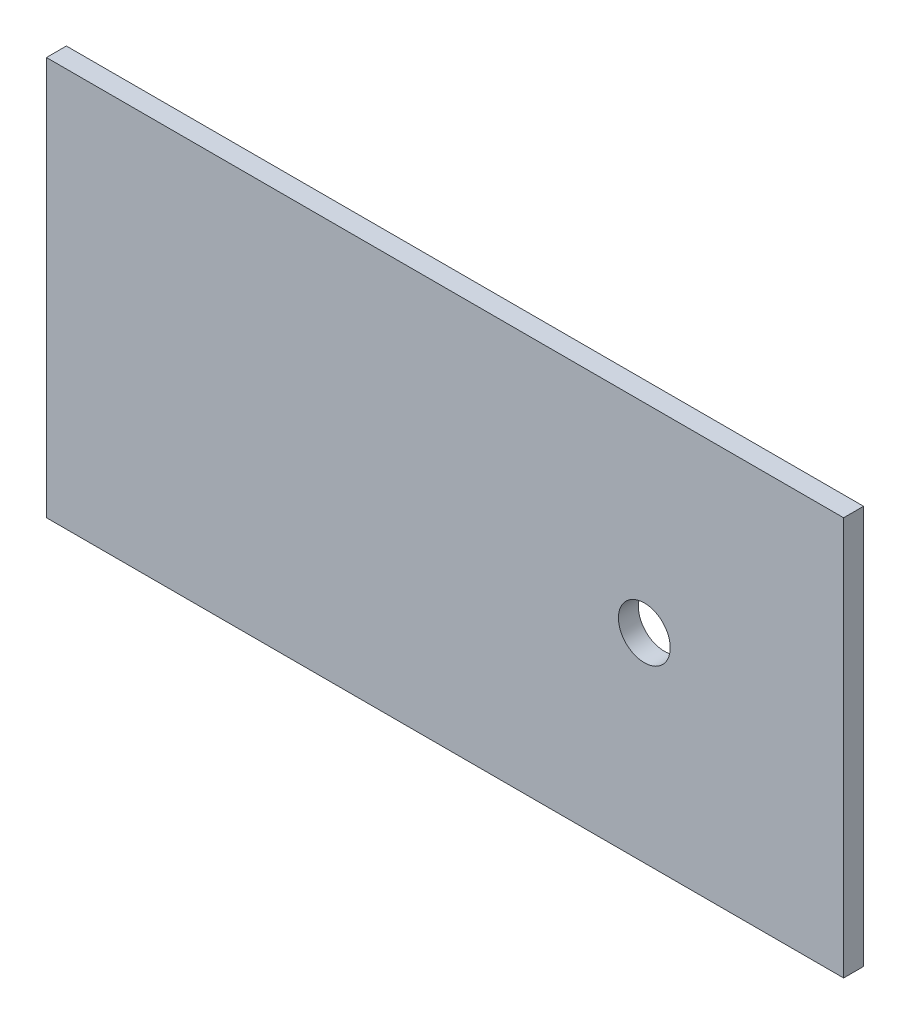
ISO-10303-21;
HEADER;
FILE_DESCRIPTION(('STEP AP214'),'2;1');
FILE_NAME('part.step','',(''),(''),'','','');
FILE_SCHEMA(('AUTOMOTIVE_DESIGN { 1 0 10303 214 1 1 1 1 }'));
ENDSEC;
DATA;
#1=APPLICATION_CONTEXT('core data for automotive mechanical design processes');
#2=APPLICATION_PROTOCOL_DEFINITION('international standard','automotive_design',2000,#1);
#3=PRODUCT_CONTEXT('',#1,'mechanical');
#4=PRODUCT('Part','Part','',(#3));
#5=PRODUCT_RELATED_PRODUCT_CATEGORY('part','',(#4));
#6=PRODUCT_DEFINITION_FORMATION('','',#4);
#7=PRODUCT_DEFINITION_CONTEXT('part definition',#1,'design');
#8=PRODUCT_DEFINITION('design','',#6,#7);
#9=PRODUCT_DEFINITION_SHAPE('','',#8);
#10=(LENGTH_UNIT() NAMED_UNIT(*) SI_UNIT(.MILLI.,.METRE.));
#11=(NAMED_UNIT(*) PLANE_ANGLE_UNIT() SI_UNIT($,.RADIAN.));
#12=(NAMED_UNIT(*) SI_UNIT($,.STERADIAN.) SOLID_ANGLE_UNIT());
#13=UNCERTAINTY_MEASURE_WITH_UNIT(LENGTH_MEASURE(1.E-05),#10,'distance_accuracy_value','');
#14=(GEOMETRIC_REPRESENTATION_CONTEXT(3) GLOBAL_UNCERTAINTY_ASSIGNED_CONTEXT((#13)) GLOBAL_UNIT_ASSIGNED_CONTEXT((#10,
#11,#12)) REPRESENTATION_CONTEXT('',''));
#15=CARTESIAN_POINT('',(0.,0.,0.));
#16=DIRECTION('',(0.,0.,1.));
#17=DIRECTION('',(1.,0.,0.));
#18=AXIS2_PLACEMENT_3D('',#15,#16,#17);
#19=CARTESIAN_POINT('',(-100.,50.,5.));
#20=DIRECTION('',(1.,0.,0.));
#21=DIRECTION('',(0.,1.,0.));
#22=AXIS2_PLACEMENT_3D('',#19,#20,#21);
#23=PLANE('',#22);
#24=DIRECTION('',(0.,-1.,0.));
#25=VECTOR('',#24,1.);
#26=CARTESIAN_POINT('',(-100.,50.,0.));
#27=LINE('',#26,#25);
#28=CARTESIAN_POINT('',(-100.,50.,0.));
#29=VERTEX_POINT('',#28);
#30=CARTESIAN_POINT('',(-100.,-50.,0.));
#31=VERTEX_POINT('',#30);
#32=EDGE_CURVE('E107',#29,#31,#27,.T.);
#33=ORIENTED_EDGE('',*,*,#32,.T.);
#34=DIRECTION('',(0.,0.,-1.));
#35=VECTOR('',#34,1.);
#36=CARTESIAN_POINT('',(-100.,-50.,5.));
#37=LINE('',#36,#35);
#38=CARTESIAN_POINT('',(-100.,-50.,5.));
#39=VERTEX_POINT('',#38);
#40=EDGE_CURVE('E11',#39,#31,#37,.T.);
#41=ORIENTED_EDGE('',*,*,#40,.F.);
#42=DIRECTION('',(0.,-1.,0.));
#43=VECTOR('',#42,1.);
#44=CARTESIAN_POINT('',(-100.,50.,5.));
#45=LINE('',#44,#43);
#46=CARTESIAN_POINT('',(-100.,50.,5.));
#47=VERTEX_POINT('',#46);
#48=EDGE_CURVE('E89',#47,#39,#45,.T.);
#49=ORIENTED_EDGE('',*,*,#48,.F.);
#50=DIRECTION('',(0.,0.,-1.));
#51=VECTOR('',#50,1.);
#52=CARTESIAN_POINT('',(-100.,50.,5.));
#53=LINE('',#52,#51);
#54=EDGE_CURVE('E56',#47,#29,#53,.T.);
#55=ORIENTED_EDGE('',*,*,#54,.T.);
#56=EDGE_LOOP('',(#33,#41,#49,#55));
#57=FACE_BOUND('',#56,.T.);
#58=ADVANCED_FACE('F39',(#57),#23,.F.);
#59=CARTESIAN_POINT('',(-100.,-50.,5.));
#60=DIRECTION('',(0.,1.,0.));
#61=DIRECTION('',(0.,0.,1.));
#62=AXIS2_PLACEMENT_3D('',#59,#60,#61);
#63=PLANE('',#62);
#64=DIRECTION('',(1.,0.,0.));
#65=VECTOR('',#64,1.);
#66=CARTESIAN_POINT('',(-100.,-50.,0.));
#67=LINE('',#66,#65);
#68=CARTESIAN_POINT('',(100.,-50.,0.));
#69=VERTEX_POINT('',#68);
#70=EDGE_CURVE('E95',#31,#69,#67,.T.);
#71=ORIENTED_EDGE('',*,*,#70,.T.);
#72=DIRECTION('',(0.,0.,-1.));
#73=VECTOR('',#72,1.);
#74=CARTESIAN_POINT('',(100.,-50.,5.));
#75=LINE('',#74,#73);
#76=CARTESIAN_POINT('',(100.,-50.,5.));
#77=VERTEX_POINT('',#76);
#78=EDGE_CURVE('E48',#77,#69,#75,.T.);
#79=ORIENTED_EDGE('',*,*,#78,.F.);
#80=DIRECTION('',(1.,0.,0.));
#81=VECTOR('',#80,1.);
#82=CARTESIAN_POINT('',(-100.,-50.,5.));
#83=LINE('',#82,#81);
#84=EDGE_CURVE('E81',#39,#77,#83,.T.);
#85=ORIENTED_EDGE('',*,*,#84,.F.);
#86=ORIENTED_EDGE('',*,*,#40,.T.);
#87=EDGE_LOOP('',(#71,#79,#85,#86));
#88=FACE_BOUND('',#87,.T.);
#89=ADVANCED_FACE('F94',(#88),#63,.F.);
#90=CARTESIAN_POINT('',(100.,50.,5.));
#91=DIRECTION('',(1.,0.,0.));
#92=DIRECTION('',(0.,1.,0.));
#93=AXIS2_PLACEMENT_3D('',#90,#91,#92);
#94=PLANE('',#93);
#95=DIRECTION('',(0.,-1.,0.));
#96=VECTOR('',#95,1.);
#97=CARTESIAN_POINT('',(100.,50.,0.));
#98=LINE('',#97,#96);
#99=CARTESIAN_POINT('',(100.,50.,0.));
#100=VERTEX_POINT('',#99);
#101=EDGE_CURVE('E113',#100,#69,#98,.T.);
#102=ORIENTED_EDGE('',*,*,#101,.F.);
#103=DIRECTION('',(0.,0.,-1.));
#104=VECTOR('',#103,1.);
#105=CARTESIAN_POINT('',(100.,50.,5.));
#106=LINE('',#105,#104);
#107=CARTESIAN_POINT('',(100.,50.,5.));
#108=VERTEX_POINT('',#107);
#109=EDGE_CURVE('E70',#108,#100,#106,.T.);
#110=ORIENTED_EDGE('',*,*,#109,.F.);
#111=DIRECTION('',(0.,-1.,0.));
#112=VECTOR('',#111,1.);
#113=CARTESIAN_POINT('',(100.,50.,5.));
#114=LINE('',#113,#112);
#115=EDGE_CURVE('E88',#108,#77,#114,.T.);
#116=ORIENTED_EDGE('',*,*,#115,.T.);
#117=ORIENTED_EDGE('',*,*,#78,.T.);
#118=EDGE_LOOP('',(#102,#110,#116,#117));
#119=FACE_BOUND('',#118,.T.);
#120=ADVANCED_FACE('F99',(#119),#94,.T.);
#121=CARTESIAN_POINT('',(-100.,50.,5.));
#122=DIRECTION('',(0.,1.,0.));
#123=DIRECTION('',(0.,0.,1.));
#124=AXIS2_PLACEMENT_3D('',#121,#122,#123);
#125=PLANE('',#124);
#126=DIRECTION('',(1.,0.,0.));
#127=VECTOR('',#126,1.);
#128=CARTESIAN_POINT('',(-100.,50.,0.));
#129=LINE('',#128,#127);
#130=EDGE_CURVE('E116',#29,#100,#129,.T.);
#131=ORIENTED_EDGE('',*,*,#130,.F.);
#132=ORIENTED_EDGE('',*,*,#54,.F.);
#133=DIRECTION('',(1.,0.,0.));
#134=VECTOR('',#133,1.);
#135=CARTESIAN_POINT('',(-100.,50.,5.));
#136=LINE('',#135,#134);
#137=EDGE_CURVE('E101',#47,#108,#136,.T.);
#138=ORIENTED_EDGE('',*,*,#137,.T.);
#139=ORIENTED_EDGE('',*,*,#109,.T.);
#140=EDGE_LOOP('',(#131,#132,#138,#139));
#141=FACE_BOUND('',#140,.T.);
#142=ADVANCED_FACE('F143',(#141),#125,.T.);
#143=CARTESIAN_POINT('',(0.,0.,5.));
#144=DIRECTION('',(0.,0.,1.));
#145=DIRECTION('',(1.,0.,0.));
#146=AXIS2_PLACEMENT_3D('',#143,#144,#145);
#147=PLANE('',#146);
#148=CARTESIAN_POINT('',(50.,0.,5.));
#149=DIRECTION('',(0.,0.,1.));
#150=DIRECTION('',(1.,0.,0.));
#151=AXIS2_PLACEMENT_3D('',#148,#149,#150);
#152=CIRCLE('',#151,6.5);
#153=CARTESIAN_POINT('',(56.5,0.,5.));
#154=VERTEX_POINT('',#153);
#155=EDGE_CURVE('E126',#154,#154,#152,.T.);
#156=ORIENTED_EDGE('',*,*,#155,.F.);
#157=EDGE_LOOP('',(#156));
#158=FACE_BOUND('',#157,.T.);
#159=ORIENTED_EDGE('',*,*,#48,.T.);
#160=ORIENTED_EDGE('',*,*,#84,.T.);
#161=ORIENTED_EDGE('',*,*,#115,.F.);
#162=ORIENTED_EDGE('',*,*,#137,.F.);
#163=EDGE_LOOP('',(#159,#160,#161,#162));
#164=FACE_BOUND('',#163,.T.);
#165=ADVANCED_FACE('F85',(#158,#164),#147,.T.);
#166=CARTESIAN_POINT('',(0.,0.,0.));
#167=DIRECTION('',(0.,0.,1.));
#168=DIRECTION('',(1.,0.,0.));
#169=AXIS2_PLACEMENT_3D('',#166,#167,#168);
#170=PLANE('',#169);
#171=CARTESIAN_POINT('',(50.,0.,0.));
#172=DIRECTION('',(0.,0.,1.));
#173=DIRECTION('',(1.,0.,0.));
#174=AXIS2_PLACEMENT_3D('',#171,#172,#173);
#175=CIRCLE('',#174,6.5);
#176=CARTESIAN_POINT('',(56.5,0.,0.));
#177=VERTEX_POINT('',#176);
#178=EDGE_CURVE('E110',#177,#177,#175,.T.);
#179=ORIENTED_EDGE('',*,*,#178,.T.);
#180=EDGE_LOOP('',(#179));
#181=FACE_BOUND('',#180,.T.);
#182=ORIENTED_EDGE('',*,*,#32,.F.);
#183=ORIENTED_EDGE('',*,*,#130,.T.);
#184=ORIENTED_EDGE('',*,*,#101,.T.);
#185=ORIENTED_EDGE('',*,*,#70,.F.);
#186=EDGE_LOOP('',(#182,#183,#184,#185));
#187=FACE_BOUND('',#186,.T.);
#188=ADVANCED_FACE('F134',(#181,#187),#170,.F.);
#189=CARTESIAN_POINT('',(50.,0.,0.));
#190=DIRECTION('',(0.,0.,1.));
#191=DIRECTION('',(1.,0.,0.));
#192=AXIS2_PLACEMENT_3D('',#189,#190,#191);
#193=CYLINDRICAL_SURFACE('',#192,6.5);
#194=ORIENTED_EDGE('',*,*,#178,.F.);
#195=EDGE_LOOP('',(#194));
#196=FACE_BOUND('',#195,.T.);
#197=ORIENTED_EDGE('',*,*,#155,.T.);
#198=EDGE_LOOP('',(#197));
#199=FACE_BOUND('',#198,.T.);
#200=ADVANCED_FACE('F136',(#196,#199),#193,.F.);
#201=CLOSED_SHELL('',(#58,#89,#120,#142,#165,#188,#200));
#202=MANIFOLD_SOLID_BREP('B2',#201);
#203=ADVANCED_BREP_SHAPE_REPRESENTATION('',(#18,#202),#14);
#204=SHAPE_DEFINITION_REPRESENTATION(#9,#203);
ENDSEC;
END-ISO-10303-21;
